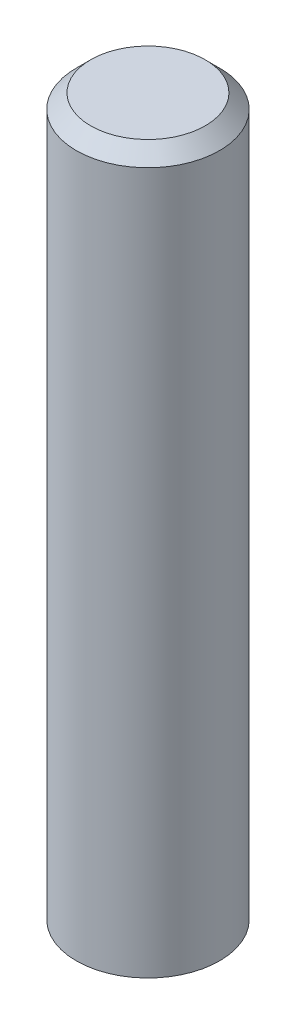
ISO-10303-21;
HEADER;
FILE_DESCRIPTION(('STEP AP214'),'2;1');
FILE_NAME('part.step','',(''),(''),'','','');
FILE_SCHEMA(('AUTOMOTIVE_DESIGN { 1 0 10303 214 1 1 1 1 }'));
ENDSEC;
DATA;
#1=APPLICATION_CONTEXT('core data for automotive mechanical design processes');
#2=APPLICATION_PROTOCOL_DEFINITION('international standard','automotive_design',2000,#1);
#3=PRODUCT_CONTEXT('',#1,'mechanical');
#4=PRODUCT('Part','Part','',(#3));
#5=PRODUCT_RELATED_PRODUCT_CATEGORY('part','',(#4));
#6=PRODUCT_DEFINITION_FORMATION('','',#4);
#7=PRODUCT_DEFINITION_CONTEXT('part definition',#1,'design');
#8=PRODUCT_DEFINITION('design','',#6,#7);
#9=PRODUCT_DEFINITION_SHAPE('','',#8);
#10=(LENGTH_UNIT() NAMED_UNIT(*) SI_UNIT(.MILLI.,.METRE.));
#11=(NAMED_UNIT(*) PLANE_ANGLE_UNIT() SI_UNIT($,.RADIAN.));
#12=(NAMED_UNIT(*) SI_UNIT($,.STERADIAN.) SOLID_ANGLE_UNIT());
#13=UNCERTAINTY_MEASURE_WITH_UNIT(LENGTH_MEASURE(1.E-05),#10,'distance_accuracy_value','');
#14=(GEOMETRIC_REPRESENTATION_CONTEXT(3) GLOBAL_UNCERTAINTY_ASSIGNED_CONTEXT((#13)) GLOBAL_UNIT_ASSIGNED_CONTEXT((#10,
#11,#12)) REPRESENTATION_CONTEXT('',''));
#15=CARTESIAN_POINT('',(0.,0.,0.));
#16=DIRECTION('',(0.,0.,1.));
#17=DIRECTION('',(1.,0.,0.));
#18=AXIS2_PLACEMENT_3D('',#15,#16,#17);
#19=CARTESIAN_POINT('',(0.,2.5,0.));
#20=DIRECTION('',(0.,-1.,0.));
#21=DIRECTION('',(0.,0.,-1.));
#22=AXIS2_PLACEMENT_3D('',#19,#20,#21);
#23=CYLINDRICAL_SURFACE('',#22,0.5);
#24=CARTESIAN_POINT('',(0.,2.4,0.));
#25=DIRECTION('',(0.,1.,0.));
#26=DIRECTION('',(0.,0.,1.));
#27=AXIS2_PLACEMENT_3D('',#24,#25,#26);
#28=CIRCLE('',#27,0.5);
#29=CARTESIAN_POINT('',(0.,2.4,0.5));
#30=VERTEX_POINT('',#29);
#31=EDGE_CURVE('E10',#30,#30,#28,.F.);
#32=ORIENTED_EDGE('',*,*,#31,.T.);
#33=EDGE_LOOP('',(#32));
#34=FACE_BOUND('',#33,.T.);
#35=CARTESIAN_POINT('',(0.,-2.5,0.));
#36=DIRECTION('',(0.,1.,0.));
#37=DIRECTION('',(0.,0.,1.));
#38=AXIS2_PLACEMENT_3D('',#35,#36,#37);
#39=CIRCLE('',#38,0.5);
#40=CARTESIAN_POINT('',(0.,-2.5,0.5));
#41=VERTEX_POINT('',#40);
#42=EDGE_CURVE('E42',#41,#41,#39,.T.);
#43=ORIENTED_EDGE('',*,*,#42,.T.);
#44=EDGE_LOOP('',(#43));
#45=FACE_BOUND('',#44,.T.);
#46=ADVANCED_FACE('F31',(#34,#45),#23,.T.);
#47=CARTESIAN_POINT('',(0.,2.5,0.));
#48=DIRECTION('',(0.,1.,0.));
#49=DIRECTION('',(0.,0.,1.));
#50=AXIS2_PLACEMENT_3D('',#47,#48,#49);
#51=PLANE('',#50);
#52=CARTESIAN_POINT('',(0.,2.5,0.));
#53=DIRECTION('',(0.,1.,0.));
#54=DIRECTION('',(0.,0.,1.));
#55=AXIS2_PLACEMENT_3D('',#52,#53,#54);
#56=CIRCLE('',#55,0.4);
#57=CARTESIAN_POINT('',(0.,2.5,0.4));
#58=VERTEX_POINT('',#57);
#59=EDGE_CURVE('E38',#58,#58,#56,.T.);
#60=ORIENTED_EDGE('',*,*,#59,.T.);
#61=EDGE_LOOP('',(#60));
#62=FACE_BOUND('',#61,.T.);
#63=ADVANCED_FACE('F52',(#62),#51,.T.);
#64=CARTESIAN_POINT('',(0.,-2.5,0.));
#65=DIRECTION('',(0.,1.,0.));
#66=DIRECTION('',(0.,0.,1.));
#67=AXIS2_PLACEMENT_3D('',#64,#65,#66);
#68=PLANE('',#67);
#69=ORIENTED_EDGE('',*,*,#42,.F.);
#70=EDGE_LOOP('',(#69));
#71=FACE_BOUND('',#70,.T.);
#72=ADVANCED_FACE('F50',(#71),#68,.F.);
#73=CARTESIAN_POINT('',(0.,2.5,0.));
#74=DIRECTION('',(0.,-1.,0.));
#75=DIRECTION('',(0.,0.,-1.));
#76=AXIS2_PLACEMENT_3D('',#73,#74,#75);
#77=CONICAL_SURFACE('',#76,0.4,0.785398163397448);
#78=ORIENTED_EDGE('',*,*,#31,.F.);
#79=EDGE_LOOP('',(#78));
#80=FACE_BOUND('',#79,.T.);
#81=ORIENTED_EDGE('',*,*,#59,.F.);
#82=EDGE_LOOP('',(#81));
#83=FACE_BOUND('',#82,.T.);
#84=ADVANCED_FACE('F33',(#80,#83),#77,.T.);
#85=CLOSED_SHELL('',(#46,#63,#72,#84));
#86=MANIFOLD_SOLID_BREP('B2',#85);
#87=ADVANCED_BREP_SHAPE_REPRESENTATION('',(#18,#86),#14);
#88=SHAPE_DEFINITION_REPRESENTATION(#9,#87);
ENDSEC;
END-ISO-10303-21;
